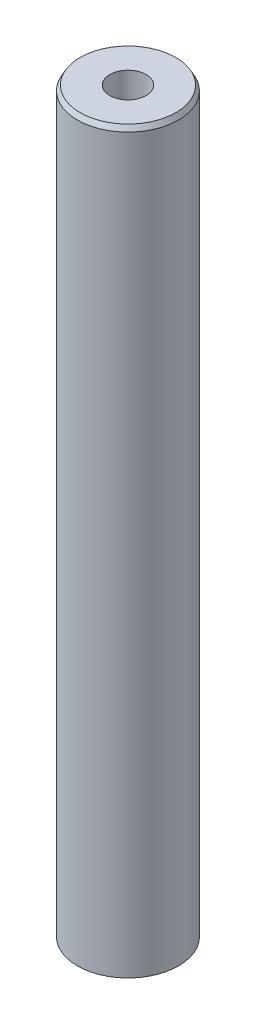
ISO-10303-21;
HEADER;
FILE_DESCRIPTION(('STEP AP214'),'2;1');
FILE_NAME('part.step','',(''),(''),'','','');
FILE_SCHEMA(('AUTOMOTIVE_DESIGN { 1 0 10303 214 1 1 1 1 }'));
ENDSEC;
DATA;
#1=APPLICATION_CONTEXT('core data for automotive mechanical design processes');
#2=APPLICATION_PROTOCOL_DEFINITION('international standard','automotive_design',2000,#1);
#3=PRODUCT_CONTEXT('',#1,'mechanical');
#4=PRODUCT('Part','Part','',(#3));
#5=PRODUCT_RELATED_PRODUCT_CATEGORY('part','',(#4));
#6=PRODUCT_DEFINITION_FORMATION('','',#4);
#7=PRODUCT_DEFINITION_CONTEXT('part definition',#1,'design');
#8=PRODUCT_DEFINITION('design','',#6,#7);
#9=PRODUCT_DEFINITION_SHAPE('','',#8);
#10=(LENGTH_UNIT() NAMED_UNIT(*) SI_UNIT(.MILLI.,.METRE.));
#11=(NAMED_UNIT(*) PLANE_ANGLE_UNIT() SI_UNIT($,.RADIAN.));
#12=(NAMED_UNIT(*) SI_UNIT($,.STERADIAN.) SOLID_ANGLE_UNIT());
#13=UNCERTAINTY_MEASURE_WITH_UNIT(LENGTH_MEASURE(1.E-05),#10,'distance_accuracy_value','');
#14=(GEOMETRIC_REPRESENTATION_CONTEXT(3) GLOBAL_UNCERTAINTY_ASSIGNED_CONTEXT((#13)) GLOBAL_UNIT_ASSIGNED_CONTEXT((#10,
#11,#12)) REPRESENTATION_CONTEXT('',''));
#15=CARTESIAN_POINT('',(0.,0.,0.));
#16=DIRECTION('',(0.,0.,1.));
#17=DIRECTION('',(1.,0.,0.));
#18=AXIS2_PLACEMENT_3D('',#15,#16,#17);
#19=CARTESIAN_POINT('',(0.,219.583064211065,0.));
#20=DIRECTION('',(0.,-1.,0.));
#21=DIRECTION('',(0.,0.,-1.));
#22=AXIS2_PLACEMENT_3D('',#19,#20,#21);
#23=CYLINDRICAL_SURFACE('',#22,15.);
#24=CARTESIAN_POINT('',(0.,218.093970268849,0.));
#25=DIRECTION('',(0.,1.,0.));
#26=DIRECTION('',(0.,0.,1.));
#27=AXIS2_PLACEMENT_3D('',#24,#25,#26);
#28=CIRCLE('',#27,15.);
#29=CARTESIAN_POINT('',(0.,218.093970268849,15.));
#30=VERTEX_POINT('',#29);
#31=EDGE_CURVE('E50',#30,#30,#28,.F.);
#32=ORIENTED_EDGE('',*,*,#31,.T.);
#33=EDGE_LOOP('',(#32));
#34=FACE_BOUND('',#33,.T.);
#35=CARTESIAN_POINT('',(0.,0.815301302850957,0.));
#36=DIRECTION('',(0.,1.,0.));
#37=DIRECTION('',(0.,0.,1.));
#38=AXIS2_PLACEMENT_3D('',#35,#36,#37);
#39=CIRCLE('',#38,15.);
#40=CARTESIAN_POINT('',(0.,0.815301302850957,15.));
#41=VERTEX_POINT('',#40);
#42=EDGE_CURVE('E51',#41,#41,#39,.T.);
#43=ORIENTED_EDGE('',*,*,#42,.T.);
#44=EDGE_LOOP('',(#43));
#45=FACE_BOUND('',#44,.T.);
#46=ADVANCED_FACE('F39',(#34,#45),#23,.T.);
#47=CARTESIAN_POINT('',(0.,219.583064211065,0.));
#48=DIRECTION('',(0.,1.,0.));
#49=DIRECTION('',(0.,0.,1.));
#50=AXIS2_PLACEMENT_3D('',#47,#48,#49);
#51=PLANE('',#50);
#52=CARTESIAN_POINT('',(0.,219.583064211065,0.));
#53=DIRECTION('',(0.,1.,0.));
#54=DIRECTION('',(0.,0.,1.));
#55=AXIS2_PLACEMENT_3D('',#52,#53,#54);
#56=CIRCLE('',#55,14.1846986971491);
#57=CARTESIAN_POINT('',(0.,219.583064211065,14.1846986971491));
#58=VERTEX_POINT('',#57);
#59=EDGE_CURVE('E54',#58,#58,#56,.T.);
#60=ORIENTED_EDGE('',*,*,#59,.T.);
#61=EDGE_LOOP('',(#60));
#62=FACE_BOUND('',#61,.T.);
#63=CARTESIAN_POINT('',(0.,219.583064211065,0.));
#64=DIRECTION('',(0.,1.,0.));
#65=DIRECTION('',(0.,0.,1.));
#66=AXIS2_PLACEMENT_3D('',#63,#64,#65);
#67=CIRCLE('',#66,5.39635272532315);
#68=CARTESIAN_POINT('',(0.,219.583064211065,5.39635272532315));
#69=VERTEX_POINT('',#68);
#70=EDGE_CURVE('E58',#69,#69,#67,.T.);
#71=ORIENTED_EDGE('',*,*,#70,.F.);
#72=EDGE_LOOP('',(#71));
#73=FACE_BOUND('',#72,.T.);
#74=ADVANCED_FACE('F69',(#62,#73),#51,.T.);
#75=CARTESIAN_POINT('',(0.,0.,0.));
#76=DIRECTION('',(0.,1.,0.));
#77=DIRECTION('',(0.,0.,1.));
#78=AXIS2_PLACEMENT_3D('',#75,#76,#77);
#79=PLANE('',#78);
#80=CARTESIAN_POINT('',(0.,0.,0.));
#81=DIRECTION('',(0.,1.,0.));
#82=DIRECTION('',(0.,0.,1.));
#83=AXIS2_PLACEMENT_3D('',#80,#81,#82);
#84=CIRCLE('',#83,13.5109060577833);
#85=CARTESIAN_POINT('',(0.,0.,13.5109060577833));
#86=VERTEX_POINT('',#85);
#87=EDGE_CURVE('E10',#86,#86,#84,.F.);
#88=ORIENTED_EDGE('',*,*,#87,.T.);
#89=EDGE_LOOP('',(#88));
#90=FACE_BOUND('',#89,.T.);
#91=CARTESIAN_POINT('',(0.,0.,0.));
#92=DIRECTION('',(0.,1.,0.));
#93=DIRECTION('',(0.,0.,1.));
#94=AXIS2_PLACEMENT_3D('',#91,#92,#93);
#95=CIRCLE('',#94,5.39635272532315);
#96=CARTESIAN_POINT('',(0.,0.,5.39635272532315));
#97=VERTEX_POINT('',#96);
#98=EDGE_CURVE('E63',#97,#97,#95,.T.);
#99=ORIENTED_EDGE('',*,*,#98,.T.);
#100=EDGE_LOOP('',(#99));
#101=FACE_BOUND('',#100,.T.);
#102=ADVANCED_FACE('F75',(#90,#101),#79,.F.);
#103=CARTESIAN_POINT('',(0.,219.583064211065,0.));
#104=DIRECTION('',(0.,-1.,0.));
#105=DIRECTION('',(0.,0.,-1.));
#106=AXIS2_PLACEMENT_3D('',#103,#104,#105);
#107=CYLINDRICAL_SURFACE('',#106,5.39635272532315);
#108=ORIENTED_EDGE('',*,*,#70,.T.);
#109=EDGE_LOOP('',(#108));
#110=FACE_BOUND('',#109,.T.);
#111=ORIENTED_EDGE('',*,*,#98,.F.);
#112=EDGE_LOOP('',(#111));
#113=FACE_BOUND('',#112,.T.);
#114=ADVANCED_FACE('F70',(#110,#113),#107,.F.);
#115=CARTESIAN_POINT('',(0.,219.583064211065,0.));
#116=DIRECTION('',(0.,-1.,0.));
#117=DIRECTION('',(0.,0.,-1.));
#118=AXIS2_PLACEMENT_3D('',#115,#116,#117);
#119=CONICAL_SURFACE('',#118,14.1846986971491,0.50093335677444);
#120=ORIENTED_EDGE('',*,*,#31,.F.);
#121=EDGE_LOOP('',(#120));
#122=FACE_BOUND('',#121,.T.);
#123=ORIENTED_EDGE('',*,*,#59,.F.);
#124=EDGE_LOOP('',(#123));
#125=FACE_BOUND('',#124,.T.);
#126=ADVANCED_FACE('F81',(#122,#125),#119,.T.);
#127=CARTESIAN_POINT('',(0.,0.815301302850957,0.));
#128=DIRECTION('',(0.,1.,0.));
#129=DIRECTION('',(0.,0.,1.));
#130=AXIS2_PLACEMENT_3D('',#127,#128,#129);
#131=CONICAL_SURFACE('',#130,15.,1.06986297002045);
#132=ORIENTED_EDGE('',*,*,#87,.F.);
#133=EDGE_LOOP('',(#132));
#134=FACE_BOUND('',#133,.T.);
#135=ORIENTED_EDGE('',*,*,#42,.F.);
#136=EDGE_LOOP('',(#135));
#137=FACE_BOUND('',#136,.T.);
#138=ADVANCED_FACE('F45',(#134,#137),#131,.T.);
#139=CLOSED_SHELL('',(#46,#74,#102,#114,#126,#138));
#140=MANIFOLD_SOLID_BREP('B2',#139);
#141=ADVANCED_BREP_SHAPE_REPRESENTATION('',(#18,#140),#14);
#142=SHAPE_DEFINITION_REPRESENTATION(#9,#141);
ENDSEC;
END-ISO-10303-21;
